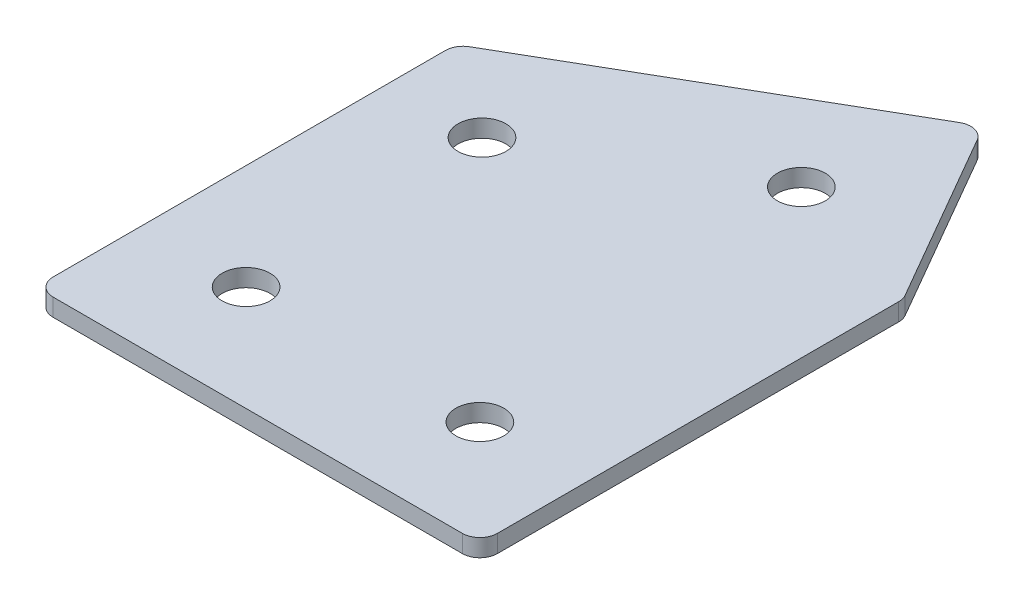
ISO-10303-21;
HEADER;
FILE_DESCRIPTION(('STEP AP214'),'2;1');
FILE_NAME('part.step','',(''),(''),'','','');
FILE_SCHEMA(('AUTOMOTIVE_DESIGN { 1 0 10303 214 1 1 1 1 }'));
ENDSEC;
DATA;
#1=APPLICATION_CONTEXT('core data for automotive mechanical design processes');
#2=APPLICATION_PROTOCOL_DEFINITION('international standard','automotive_design',2000,#1);
#3=PRODUCT_CONTEXT('',#1,'mechanical');
#4=PRODUCT('Part','Part','',(#3));
#5=PRODUCT_RELATED_PRODUCT_CATEGORY('part','',(#4));
#6=PRODUCT_DEFINITION_FORMATION('','',#4);
#7=PRODUCT_DEFINITION_CONTEXT('part definition',#1,'design');
#8=PRODUCT_DEFINITION('design','',#6,#7);
#9=PRODUCT_DEFINITION_SHAPE('','',#8);
#10=(LENGTH_UNIT() NAMED_UNIT(*) SI_UNIT(.MILLI.,.METRE.));
#11=(NAMED_UNIT(*) PLANE_ANGLE_UNIT() SI_UNIT($,.RADIAN.));
#12=(NAMED_UNIT(*) SI_UNIT($,.STERADIAN.) SOLID_ANGLE_UNIT());
#13=UNCERTAINTY_MEASURE_WITH_UNIT(LENGTH_MEASURE(1.E-05),#10,'distance_accuracy_value','');
#14=(GEOMETRIC_REPRESENTATION_CONTEXT(3) GLOBAL_UNCERTAINTY_ASSIGNED_CONTEXT((#13)) GLOBAL_UNIT_ASSIGNED_CONTEXT((#10,
#11,#12)) REPRESENTATION_CONTEXT('',''));
#15=CARTESIAN_POINT('',(0.,0.,0.));
#16=DIRECTION('',(0.,0.,1.));
#17=DIRECTION('',(1.,0.,0.));
#18=AXIS2_PLACEMENT_3D('',#15,#16,#17);
#19=CARTESIAN_POINT('',(0.,0.,0.));
#20=DIRECTION('',(0.,1.,0.));
#21=DIRECTION('',(0.,0.,1.));
#22=AXIS2_PLACEMENT_3D('',#19,#20,#21);
#23=PLANE('',#22);
#24=CARTESIAN_POINT('',(80.,0.,0.));
#25=DIRECTION('',(0.,1.,0.));
#26=DIRECTION('',(0.,0.,1.));
#27=AXIS2_PLACEMENT_3D('',#24,#25,#26);
#28=CIRCLE('',#27,4.09999999999999);
#29=CARTESIAN_POINT('',(80.,0.,4.09999999999999));
#30=VERTEX_POINT('',#29);
#31=EDGE_CURVE('E201',#30,#30,#28,.T.);
#32=ORIENTED_EDGE('',*,*,#31,.T.);
#33=EDGE_LOOP('',(#32));
#34=FACE_BOUND('',#33,.T.);
#35=CARTESIAN_POINT('',(72.6794919243112,0.,-62.3205080756889));
#36=DIRECTION('',(0.,1.,0.));
#37=DIRECTION('',(0.,0.,1.));
#38=AXIS2_PLACEMENT_3D('',#35,#36,#37);
#39=CIRCLE('',#38,4.09999999999997);
#40=CARTESIAN_POINT('',(72.6794919243112,0.,-58.2205080756889));
#41=VERTEX_POINT('',#40);
#42=EDGE_CURVE('E195',#41,#41,#39,.T.);
#43=ORIENTED_EDGE('',*,*,#42,.T.);
#44=EDGE_LOOP('',(#43));
#45=FACE_BOUND('',#44,.T.);
#46=CARTESIAN_POINT('',(38.0384757729336,0.,-42.3205080756889));
#47=DIRECTION('',(0.,1.,0.));
#48=DIRECTION('',(0.,0.,1.));
#49=AXIS2_PLACEMENT_3D('',#46,#47,#48);
#50=CIRCLE('',#49,4.1);
#51=CARTESIAN_POINT('',(38.0384757729336,0.,-38.2205080756889));
#52=VERTEX_POINT('',#51);
#53=EDGE_CURVE('E189',#52,#52,#50,.T.);
#54=ORIENTED_EDGE('',*,*,#53,.T.);
#55=EDGE_LOOP('',(#54));
#56=FACE_BOUND('',#55,.T.);
#57=CARTESIAN_POINT('',(40.,0.,0.));
#58=DIRECTION('',(0.,1.,0.));
#59=DIRECTION('',(0.,0.,1.));
#60=AXIS2_PLACEMENT_3D('',#57,#58,#59);
#61=CIRCLE('',#60,4.1);
#62=CARTESIAN_POINT('',(40.,0.,4.10000000000001));
#63=VERTEX_POINT('',#62);
#64=EDGE_CURVE('E115',#63,#63,#61,.T.);
#65=ORIENTED_EDGE('',*,*,#64,.T.);
#66=EDGE_LOOP('',(#65));
#67=FACE_BOUND('',#66,.T.);
#68=DIRECTION('',(0.,0.,1.));
#69=VECTOR('',#68,1.);
#70=CARTESIAN_POINT('',(22.,0.,-53.8452994616209));
#71=LINE('',#70,#69);
#72=CARTESIAN_POINT('',(22.,0.,-52.113248654052));
#73=VERTEX_POINT('',#72);
#74=CARTESIAN_POINT('',(22.,0.,15.));
#75=VERTEX_POINT('',#74);
#76=EDGE_CURVE('E182',#73,#75,#71,.T.);
#77=ORIENTED_EDGE('',*,*,#76,.F.);
#78=CARTESIAN_POINT('',(25.,0.,-52.113248654052));
#79=DIRECTION('',(0.,1.,0.));
#80=DIRECTION('',(0.,0.,1.));
#81=AXIS2_PLACEMENT_3D('',#78,#79,#80);
#82=CIRCLE('',#81,3.);
#83=CARTESIAN_POINT('',(23.5,0.,-54.7113248654053));
#84=VERTEX_POINT('',#83);
#85=EDGE_CURVE('E146',#73,#84,#82,.F.);
#86=ORIENTED_EDGE('',*,*,#85,.T.);
#87=DIRECTION('',(-0.866025403784438,0.,0.5));
#88=VECTOR('',#87,1.);
#89=CARTESIAN_POINT('',(79.2679491924311,0.,-86.9089653438088));
#90=LINE('',#89,#88);
#91=CARTESIAN_POINT('',(76.6698729810778,0.,-85.4089653438088));
#92=VERTEX_POINT('',#91);
#93=EDGE_CURVE('E174',#92,#84,#90,.T.);
#94=ORIENTED_EDGE('',*,*,#93,.F.);
#95=CARTESIAN_POINT('',(78.1698729810778,0.,-82.8108891324555));
#96=DIRECTION('',(0.,1.,0.));
#97=DIRECTION('',(0.,0.,1.));
#98=AXIS2_PLACEMENT_3D('',#95,#96,#97);
#99=CIRCLE('',#98,3.);
#100=CARTESIAN_POINT('',(80.7679491924311,0.,-84.3108891324555));
#101=VERTEX_POINT('',#100);
#102=EDGE_CURVE('E118',#92,#101,#99,.F.);
#103=ORIENTED_EDGE('',*,*,#102,.T.);
#104=DIRECTION('',(-0.5,0.,-0.866025403784439));
#105=VECTOR('',#104,1.);
#106=CARTESIAN_POINT('',(98.,0.,-54.4641016151378));
#107=LINE('',#106,#105);
#108=CARTESIAN_POINT('',(97.5980762113533,0.,-55.1602540378444));
#109=VERTEX_POINT('',#108);
#110=EDGE_CURVE('E119',#109,#101,#107,.T.);
#111=ORIENTED_EDGE('',*,*,#110,.F.);
#112=CARTESIAN_POINT('',(95.,0.,-53.6602540378445));
#113=DIRECTION('',(0.,1.,0.));
#114=DIRECTION('',(0.,0.,1.));
#115=AXIS2_PLACEMENT_3D('',#112,#113,#114);
#116=CIRCLE('',#115,3.);
#117=CARTESIAN_POINT('',(98.,0.,-53.6602540378445));
#118=VERTEX_POINT('',#117);
#119=EDGE_CURVE('E141',#109,#118,#116,.F.);
#120=ORIENTED_EDGE('',*,*,#119,.T.);
#121=DIRECTION('',(0.,0.,-1.));
#122=VECTOR('',#121,1.);
#123=CARTESIAN_POINT('',(98.,0.,18.));
#124=LINE('',#123,#122);
#125=CARTESIAN_POINT('',(98.,0.,15.));
#126=VERTEX_POINT('',#125);
#127=EDGE_CURVE('E123',#126,#118,#124,.T.);
#128=ORIENTED_EDGE('',*,*,#127,.F.);
#129=CARTESIAN_POINT('',(95.,0.,15.));
#130=DIRECTION('',(0.,1.,0.));
#131=DIRECTION('',(0.,0.,1.));
#132=AXIS2_PLACEMENT_3D('',#129,#130,#131);
#133=CIRCLE('',#132,3.);
#134=CARTESIAN_POINT('',(95.,0.,18.));
#135=VERTEX_POINT('',#134);
#136=EDGE_CURVE('E31',#126,#135,#133,.F.);
#137=ORIENTED_EDGE('',*,*,#136,.T.);
#138=DIRECTION('',(1.,0.,0.));
#139=VECTOR('',#138,1.);
#140=CARTESIAN_POINT('',(22.,0.,18.));
#141=LINE('',#140,#139);
#142=CARTESIAN_POINT('',(25.,0.,18.));
#143=VERTEX_POINT('',#142);
#144=EDGE_CURVE('E180',#143,#135,#141,.T.);
#145=ORIENTED_EDGE('',*,*,#144,.F.);
#146=CARTESIAN_POINT('',(25.,0.,15.));
#147=DIRECTION('',(0.,1.,0.));
#148=DIRECTION('',(0.,0.,1.));
#149=AXIS2_PLACEMENT_3D('',#146,#147,#148);
#150=CIRCLE('',#149,3.);
#151=EDGE_CURVE('E144',#143,#75,#150,.F.);
#152=ORIENTED_EDGE('',*,*,#151,.T.);
#153=EDGE_LOOP('',(#77,#86,#94,#103,#111,#120,#128,#137,#145,#152));
#154=FACE_BOUND('',#153,.T.);
#155=ADVANCED_FACE('F16',(#34,#45,#56,#67,#154),#23,.F.);
#156=CARTESIAN_POINT('',(79.2679491924311,0.,-86.9089653438088));
#157=DIRECTION('',(-0.5,0.,-0.866025403784439));
#158=DIRECTION('',(-0.866025403784439,0.,0.5));
#159=AXIS2_PLACEMENT_3D('',#156,#157,#158);
#160=PLANE('',#159);
#161=ORIENTED_EDGE('',*,*,#93,.T.);
#162=DIRECTION('',(0.,1.,0.));
#163=VECTOR('',#162,1.);
#164=CARTESIAN_POINT('',(23.5,0.,-54.7113248654053));
#165=LINE('',#164,#163);
#166=CARTESIAN_POINT('',(23.5,3.,-54.7113248654053));
#167=VERTEX_POINT('',#166);
#168=EDGE_CURVE('E105',#84,#167,#165,.T.);
#169=ORIENTED_EDGE('',*,*,#168,.T.);
#170=DIRECTION('',(-0.866025403784438,0.,0.5));
#171=VECTOR('',#170,1.);
#172=CARTESIAN_POINT('',(79.2679491924311,3.,-86.9089653438088));
#173=LINE('',#172,#171);
#174=CARTESIAN_POINT('',(76.6698729810778,3.,-85.4089653438088));
#175=VERTEX_POINT('',#174);
#176=EDGE_CURVE('E97',#175,#167,#173,.T.);
#177=ORIENTED_EDGE('',*,*,#176,.F.);
#178=DIRECTION('',(0.,1.,0.));
#179=VECTOR('',#178,1.);
#180=CARTESIAN_POINT('',(76.6698729810778,0.,-85.4089653438088));
#181=LINE('',#180,#179);
#182=EDGE_CURVE('E111',#175,#92,#181,.F.);
#183=ORIENTED_EDGE('',*,*,#182,.T.);
#184=EDGE_LOOP('',(#161,#169,#177,#183));
#185=FACE_BOUND('',#184,.T.);
#186=ADVANCED_FACE('F110',(#185),#160,.T.);
#187=CARTESIAN_POINT('',(98.,0.,-54.4641016151378));
#188=DIRECTION('',(0.866025403784439,0.,-0.5));
#189=DIRECTION('',(-0.5,0.,-0.866025403784439));
#190=AXIS2_PLACEMENT_3D('',#187,#188,#189);
#191=PLANE('',#190);
#192=DIRECTION('',(-0.5,0.,-0.866025403784439));
#193=VECTOR('',#192,1.);
#194=CARTESIAN_POINT('',(98.,3.,-54.4641016151378));
#195=LINE('',#194,#193);
#196=CARTESIAN_POINT('',(97.5980762113533,3.,-55.1602540378444));
#197=VERTEX_POINT('',#196);
#198=CARTESIAN_POINT('',(80.7679491924311,3.,-84.3108891324555));
#199=VERTEX_POINT('',#198);
#200=EDGE_CURVE('E99',#197,#199,#195,.T.);
#201=ORIENTED_EDGE('',*,*,#200,.F.);
#202=DIRECTION('',(0.,1.,0.));
#203=VECTOR('',#202,1.);
#204=CARTESIAN_POINT('',(97.5980762113533,0.,-55.1602540378444));
#205=LINE('',#204,#203);
#206=EDGE_CURVE('E10',#197,#109,#205,.F.);
#207=ORIENTED_EDGE('',*,*,#206,.T.);
#208=ORIENTED_EDGE('',*,*,#110,.T.);
#209=DIRECTION('',(0.,1.,0.));
#210=VECTOR('',#209,1.);
#211=CARTESIAN_POINT('',(80.7679491924311,0.,-84.3108891324555));
#212=LINE('',#211,#210);
#213=EDGE_CURVE('E24',#101,#199,#212,.T.);
#214=ORIENTED_EDGE('',*,*,#213,.T.);
#215=EDGE_LOOP('',(#201,#207,#208,#214));
#216=FACE_BOUND('',#215,.T.);
#217=ADVANCED_FACE('F157',(#216),#191,.T.);
#218=CARTESIAN_POINT('',(98.,0.,18.));
#219=DIRECTION('',(1.,0.,0.));
#220=DIRECTION('',(0.,0.,-1.));
#221=AXIS2_PLACEMENT_3D('',#218,#219,#220);
#222=PLANE('',#221);
#223=DIRECTION('',(0.,0.,-1.));
#224=VECTOR('',#223,1.);
#225=CARTESIAN_POINT('',(98.,3.,18.));
#226=LINE('',#225,#224);
#227=CARTESIAN_POINT('',(98.,3.,15.));
#228=VERTEX_POINT('',#227);
#229=CARTESIAN_POINT('',(98.,3.,-53.6602540378445));
#230=VERTEX_POINT('',#229);
#231=EDGE_CURVE('E170',#228,#230,#226,.T.);
#232=ORIENTED_EDGE('',*,*,#231,.F.);
#233=DIRECTION('',(0.,1.,0.));
#234=VECTOR('',#233,1.);
#235=CARTESIAN_POINT('',(98.,0.,15.));
#236=LINE('',#235,#234);
#237=EDGE_CURVE('E155',#228,#126,#236,.F.);
#238=ORIENTED_EDGE('',*,*,#237,.T.);
#239=ORIENTED_EDGE('',*,*,#127,.T.);
#240=DIRECTION('',(0.,1.,0.));
#241=VECTOR('',#240,1.);
#242=CARTESIAN_POINT('',(98.,0.,-53.6602540378445));
#243=LINE('',#242,#241);
#244=EDGE_CURVE('E152',#118,#230,#243,.T.);
#245=ORIENTED_EDGE('',*,*,#244,.T.);
#246=EDGE_LOOP('',(#232,#238,#239,#245));
#247=FACE_BOUND('',#246,.T.);
#248=ADVANCED_FACE('F169',(#247),#222,.T.);
#249=CARTESIAN_POINT('',(22.,0.,18.));
#250=DIRECTION('',(0.,0.,1.));
#251=DIRECTION('',(1.,0.,0.));
#252=AXIS2_PLACEMENT_3D('',#249,#250,#251);
#253=PLANE('',#252);
#254=DIRECTION('',(1.,0.,0.));
#255=VECTOR('',#254,1.);
#256=CARTESIAN_POINT('',(22.,3.,18.));
#257=LINE('',#256,#255);
#258=CARTESIAN_POINT('',(25.,3.,18.));
#259=VERTEX_POINT('',#258);
#260=CARTESIAN_POINT('',(95.,3.,18.));
#261=VERTEX_POINT('',#260);
#262=EDGE_CURVE('E173',#259,#261,#257,.T.);
#263=ORIENTED_EDGE('',*,*,#262,.F.);
#264=DIRECTION('',(0.,1.,0.));
#265=VECTOR('',#264,1.);
#266=CARTESIAN_POINT('',(25.,0.,18.));
#267=LINE('',#266,#265);
#268=EDGE_CURVE('E38',#259,#143,#267,.F.);
#269=ORIENTED_EDGE('',*,*,#268,.T.);
#270=ORIENTED_EDGE('',*,*,#144,.T.);
#271=DIRECTION('',(0.,1.,0.));
#272=VECTOR('',#271,1.);
#273=CARTESIAN_POINT('',(95.,0.,18.));
#274=LINE('',#273,#272);
#275=EDGE_CURVE('E148',#135,#261,#274,.T.);
#276=ORIENTED_EDGE('',*,*,#275,.T.);
#277=EDGE_LOOP('',(#263,#269,#270,#276));
#278=FACE_BOUND('',#277,.T.);
#279=ADVANCED_FACE('F337',(#278),#253,.T.);
#280=CARTESIAN_POINT('',(22.,0.,-53.8452994616209));
#281=DIRECTION('',(-1.,0.,0.));
#282=DIRECTION('',(0.,0.,1.));
#283=AXIS2_PLACEMENT_3D('',#280,#281,#282);
#284=PLANE('',#283);
#285=DIRECTION('',(0.,0.,1.));
#286=VECTOR('',#285,1.);
#287=CARTESIAN_POINT('',(22.,3.,-53.8452994616209));
#288=LINE('',#287,#286);
#289=CARTESIAN_POINT('',(22.,3.,-52.113248654052));
#290=VERTEX_POINT('',#289);
#291=CARTESIAN_POINT('',(22.,3.,15.));
#292=VERTEX_POINT('',#291);
#293=EDGE_CURVE('E114',#290,#292,#288,.T.);
#294=ORIENTED_EDGE('',*,*,#293,.F.);
#295=DIRECTION('',(0.,1.,0.));
#296=VECTOR('',#295,1.);
#297=CARTESIAN_POINT('',(22.,0.,-52.113248654052));
#298=LINE('',#297,#296);
#299=EDGE_CURVE('E138',#290,#73,#298,.F.);
#300=ORIENTED_EDGE('',*,*,#299,.T.);
#301=ORIENTED_EDGE('',*,*,#76,.T.);
#302=DIRECTION('',(0.,1.,0.));
#303=VECTOR('',#302,1.);
#304=CARTESIAN_POINT('',(22.,0.,15.));
#305=LINE('',#304,#303);
#306=EDGE_CURVE('E135',#75,#292,#305,.T.);
#307=ORIENTED_EDGE('',*,*,#306,.T.);
#308=EDGE_LOOP('',(#294,#300,#301,#307));
#309=FACE_BOUND('',#308,.T.);
#310=ADVANCED_FACE('F223',(#309),#284,.T.);
#311=CARTESIAN_POINT('',(0.,3.,0.));
#312=DIRECTION('',(0.,1.,0.));
#313=DIRECTION('',(0.,0.,1.));
#314=AXIS2_PLACEMENT_3D('',#311,#312,#313);
#315=PLANE('',#314);
#316=CARTESIAN_POINT('',(80.,3.,0.));
#317=DIRECTION('',(0.,1.,0.));
#318=DIRECTION('',(0.,0.,1.));
#319=AXIS2_PLACEMENT_3D('',#316,#317,#318);
#320=CIRCLE('',#319,4.09999999999999);
#321=CARTESIAN_POINT('',(80.,3.,4.09999999999999));
#322=VERTEX_POINT('',#321);
#323=EDGE_CURVE('E204',#322,#322,#320,.T.);
#324=ORIENTED_EDGE('',*,*,#323,.F.);
#325=EDGE_LOOP('',(#324));
#326=FACE_BOUND('',#325,.T.);
#327=CARTESIAN_POINT('',(72.6794919243112,3.,-62.3205080756889));
#328=DIRECTION('',(0.,1.,0.));
#329=DIRECTION('',(0.,0.,1.));
#330=AXIS2_PLACEMENT_3D('',#327,#328,#329);
#331=CIRCLE('',#330,4.09999999999997);
#332=CARTESIAN_POINT('',(72.6794919243112,3.,-58.2205080756889));
#333=VERTEX_POINT('',#332);
#334=EDGE_CURVE('E198',#333,#333,#331,.T.);
#335=ORIENTED_EDGE('',*,*,#334,.F.);
#336=EDGE_LOOP('',(#335));
#337=FACE_BOUND('',#336,.T.);
#338=CARTESIAN_POINT('',(38.0384757729336,3.,-42.3205080756889));
#339=DIRECTION('',(0.,1.,0.));
#340=DIRECTION('',(0.,0.,1.));
#341=AXIS2_PLACEMENT_3D('',#338,#339,#340);
#342=CIRCLE('',#341,4.1);
#343=CARTESIAN_POINT('',(38.0384757729336,3.,-38.2205080756889));
#344=VERTEX_POINT('',#343);
#345=EDGE_CURVE('E192',#344,#344,#342,.T.);
#346=ORIENTED_EDGE('',*,*,#345,.F.);
#347=EDGE_LOOP('',(#346));
#348=FACE_BOUND('',#347,.T.);
#349=CARTESIAN_POINT('',(40.,3.,0.));
#350=DIRECTION('',(0.,1.,0.));
#351=DIRECTION('',(0.,0.,1.));
#352=AXIS2_PLACEMENT_3D('',#349,#350,#351);
#353=CIRCLE('',#352,4.1);
#354=CARTESIAN_POINT('',(40.,3.,4.10000000000001));
#355=VERTEX_POINT('',#354);
#356=EDGE_CURVE('E186',#355,#355,#353,.T.);
#357=ORIENTED_EDGE('',*,*,#356,.F.);
#358=EDGE_LOOP('',(#357));
#359=FACE_BOUND('',#358,.T.);
#360=ORIENTED_EDGE('',*,*,#176,.T.);
#361=CARTESIAN_POINT('',(25.,3.,-52.113248654052));
#362=DIRECTION('',(0.,1.,0.));
#363=DIRECTION('',(0.,0.,1.));
#364=AXIS2_PLACEMENT_3D('',#361,#362,#363);
#365=CIRCLE('',#364,3.);
#366=EDGE_CURVE('E133',#167,#290,#365,.T.);
#367=ORIENTED_EDGE('',*,*,#366,.T.);
#368=ORIENTED_EDGE('',*,*,#293,.T.);
#369=CARTESIAN_POINT('',(25.,3.,15.));
#370=DIRECTION('',(0.,1.,0.));
#371=DIRECTION('',(0.,0.,1.));
#372=AXIS2_PLACEMENT_3D('',#369,#370,#371);
#373=CIRCLE('',#372,3.);
#374=EDGE_CURVE('E131',#292,#259,#373,.T.);
#375=ORIENTED_EDGE('',*,*,#374,.T.);
#376=ORIENTED_EDGE('',*,*,#262,.T.);
#377=CARTESIAN_POINT('',(95.,3.,15.));
#378=DIRECTION('',(0.,1.,0.));
#379=DIRECTION('',(0.,0.,1.));
#380=AXIS2_PLACEMENT_3D('',#377,#378,#379);
#381=CIRCLE('',#380,3.);
#382=EDGE_CURVE('E129',#261,#228,#381,.T.);
#383=ORIENTED_EDGE('',*,*,#382,.T.);
#384=ORIENTED_EDGE('',*,*,#231,.T.);
#385=CARTESIAN_POINT('',(95.,3.,-53.6602540378445));
#386=DIRECTION('',(0.,1.,0.));
#387=DIRECTION('',(0.,0.,1.));
#388=AXIS2_PLACEMENT_3D('',#385,#386,#387);
#389=CIRCLE('',#388,3.);
#390=EDGE_CURVE('E104',#230,#197,#389,.T.);
#391=ORIENTED_EDGE('',*,*,#390,.T.);
#392=ORIENTED_EDGE('',*,*,#200,.T.);
#393=CARTESIAN_POINT('',(78.1698729810778,3.,-82.8108891324555));
#394=DIRECTION('',(0.,1.,0.));
#395=DIRECTION('',(0.,0.,1.));
#396=AXIS2_PLACEMENT_3D('',#393,#394,#395);
#397=CIRCLE('',#396,3.);
#398=EDGE_CURVE('E94',#199,#175,#397,.T.);
#399=ORIENTED_EDGE('',*,*,#398,.T.);
#400=EDGE_LOOP('',(#360,#367,#368,#375,#376,#383,#384,#391,#392,#399));
#401=FACE_BOUND('',#400,.T.);
#402=ADVANCED_FACE('F96',(#326,#337,#348,#359,#401),#315,.T.);
#403=CARTESIAN_POINT('',(40.,0.,0.));
#404=DIRECTION('',(0.,1.,0.));
#405=DIRECTION('',(0.,0.,1.));
#406=AXIS2_PLACEMENT_3D('',#403,#404,#405);
#407=CYLINDRICAL_SURFACE('',#406,4.1);
#408=ORIENTED_EDGE('',*,*,#64,.F.);
#409=EDGE_LOOP('',(#408));
#410=FACE_BOUND('',#409,.T.);
#411=ORIENTED_EDGE('',*,*,#356,.T.);
#412=EDGE_LOOP('',(#411));
#413=FACE_BOUND('',#412,.T.);
#414=ADVANCED_FACE('F222',(#410,#413),#407,.F.);
#415=CARTESIAN_POINT('',(38.0384757729336,0.,-42.3205080756889));
#416=DIRECTION('',(0.,1.,0.));
#417=DIRECTION('',(0.,0.,1.));
#418=AXIS2_PLACEMENT_3D('',#415,#416,#417);
#419=CYLINDRICAL_SURFACE('',#418,4.1);
#420=ORIENTED_EDGE('',*,*,#53,.F.);
#421=EDGE_LOOP('',(#420));
#422=FACE_BOUND('',#421,.T.);
#423=ORIENTED_EDGE('',*,*,#345,.T.);
#424=EDGE_LOOP('',(#423));
#425=FACE_BOUND('',#424,.T.);
#426=ADVANCED_FACE('F232',(#422,#425),#419,.F.);
#427=CARTESIAN_POINT('',(72.6794919243112,0.,-62.3205080756889));
#428=DIRECTION('',(0.,1.,0.));
#429=DIRECTION('',(0.,0.,1.));
#430=AXIS2_PLACEMENT_3D('',#427,#428,#429);
#431=CYLINDRICAL_SURFACE('',#430,4.09999999999997);
#432=ORIENTED_EDGE('',*,*,#42,.F.);
#433=EDGE_LOOP('',(#432));
#434=FACE_BOUND('',#433,.T.);
#435=ORIENTED_EDGE('',*,*,#334,.T.);
#436=EDGE_LOOP('',(#435));
#437=FACE_BOUND('',#436,.T.);
#438=ADVANCED_FACE('F216',(#434,#437),#431,.F.);
#439=CARTESIAN_POINT('',(80.,0.,0.));
#440=DIRECTION('',(0.,1.,0.));
#441=DIRECTION('',(0.,0.,1.));
#442=AXIS2_PLACEMENT_3D('',#439,#440,#441);
#443=CYLINDRICAL_SURFACE('',#442,4.09999999999999);
#444=ORIENTED_EDGE('',*,*,#31,.F.);
#445=EDGE_LOOP('',(#444));
#446=FACE_BOUND('',#445,.T.);
#447=ORIENTED_EDGE('',*,*,#323,.T.);
#448=EDGE_LOOP('',(#447));
#449=FACE_BOUND('',#448,.T.);
#450=ADVANCED_FACE('F212',(#446,#449),#443,.F.);
#451=CARTESIAN_POINT('',(25.,0.,-52.113248654052));
#452=DIRECTION('',(0.,1.,0.));
#453=DIRECTION('',(0.,0.,1.));
#454=AXIS2_PLACEMENT_3D('',#451,#452,#453);
#455=CYLINDRICAL_SURFACE('',#454,3.);
#456=ORIENTED_EDGE('',*,*,#85,.F.);
#457=ORIENTED_EDGE('',*,*,#299,.F.);
#458=ORIENTED_EDGE('',*,*,#366,.F.);
#459=ORIENTED_EDGE('',*,*,#168,.F.);
#460=EDGE_LOOP('',(#456,#457,#458,#459));
#461=FACE_BOUND('',#460,.T.);
#462=ADVANCED_FACE('F215',(#461),#455,.T.);
#463=CARTESIAN_POINT('',(25.,0.,15.));
#464=DIRECTION('',(0.,1.,0.));
#465=DIRECTION('',(0.,0.,1.));
#466=AXIS2_PLACEMENT_3D('',#463,#464,#465);
#467=CYLINDRICAL_SURFACE('',#466,3.);
#468=ORIENTED_EDGE('',*,*,#151,.F.);
#469=ORIENTED_EDGE('',*,*,#268,.F.);
#470=ORIENTED_EDGE('',*,*,#374,.F.);
#471=ORIENTED_EDGE('',*,*,#306,.F.);
#472=EDGE_LOOP('',(#468,#469,#470,#471));
#473=FACE_BOUND('',#472,.T.);
#474=ADVANCED_FACE('F252',(#473),#467,.T.);
#475=CARTESIAN_POINT('',(95.,0.,15.));
#476=DIRECTION('',(0.,1.,0.));
#477=DIRECTION('',(0.,0.,1.));
#478=AXIS2_PLACEMENT_3D('',#475,#476,#477);
#479=CYLINDRICAL_SURFACE('',#478,3.);
#480=ORIENTED_EDGE('',*,*,#136,.F.);
#481=ORIENTED_EDGE('',*,*,#237,.F.);
#482=ORIENTED_EDGE('',*,*,#382,.F.);
#483=ORIENTED_EDGE('',*,*,#275,.F.);
#484=EDGE_LOOP('',(#480,#481,#482,#483));
#485=FACE_BOUND('',#484,.T.);
#486=ADVANCED_FACE('F256',(#485),#479,.T.);
#487=CARTESIAN_POINT('',(95.,0.,-53.6602540378445));
#488=DIRECTION('',(0.,1.,0.));
#489=DIRECTION('',(0.,0.,1.));
#490=AXIS2_PLACEMENT_3D('',#487,#488,#489);
#491=CYLINDRICAL_SURFACE('',#490,3.);
#492=ORIENTED_EDGE('',*,*,#119,.F.);
#493=ORIENTED_EDGE('',*,*,#206,.F.);
#494=ORIENTED_EDGE('',*,*,#390,.F.);
#495=ORIENTED_EDGE('',*,*,#244,.F.);
#496=EDGE_LOOP('',(#492,#493,#494,#495));
#497=FACE_BOUND('',#496,.T.);
#498=ADVANCED_FACE('F165',(#497),#491,.T.);
#499=CARTESIAN_POINT('',(78.1698729810778,0.,-82.8108891324555));
#500=DIRECTION('',(0.,1.,0.));
#501=DIRECTION('',(0.,0.,1.));
#502=AXIS2_PLACEMENT_3D('',#499,#500,#501);
#503=CYLINDRICAL_SURFACE('',#502,3.);
#504=ORIENTED_EDGE('',*,*,#102,.F.);
#505=ORIENTED_EDGE('',*,*,#182,.F.);
#506=ORIENTED_EDGE('',*,*,#398,.F.);
#507=ORIENTED_EDGE('',*,*,#213,.F.);
#508=EDGE_LOOP('',(#504,#505,#506,#507));
#509=FACE_BOUND('',#508,.T.);
#510=ADVANCED_FACE('F18',(#509),#503,.T.);
#511=CLOSED_SHELL('',(#155,#186,#217,#248,#279,#310,#402,#414,#426,#438,#450,#462,#474,#486,
#498,#510));
#512=MANIFOLD_SOLID_BREP('B1',#511);
#513=ADVANCED_BREP_SHAPE_REPRESENTATION('',(#18,#512),#14);
#514=SHAPE_DEFINITION_REPRESENTATION(#9,#513);
ENDSEC;
END-ISO-10303-21;
